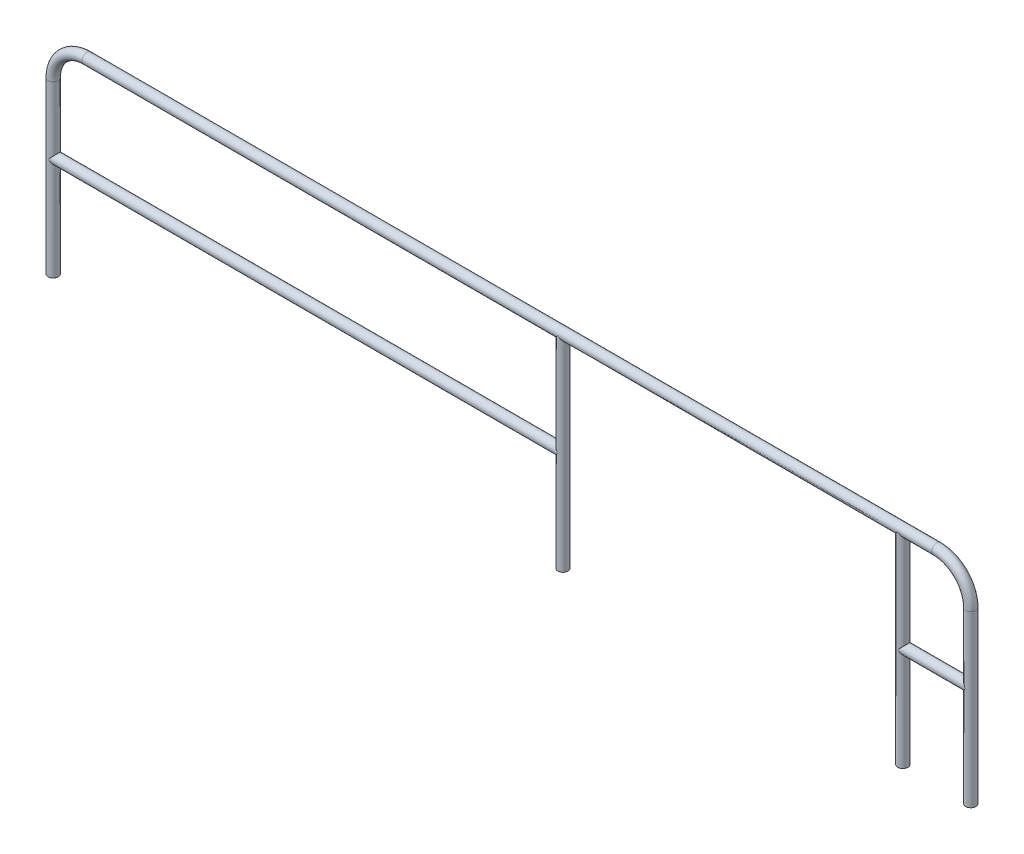
ISO-10303-21;
HEADER;
FILE_DESCRIPTION(('STEP AP214'),'2;1');
FILE_NAME('part.step','',(''),(''),'','','');
FILE_SCHEMA(('AUTOMOTIVE_DESIGN { 1 0 10303 214 1 1 1 1 }'));
ENDSEC;
DATA;
#1=APPLICATION_CONTEXT('core data for automotive mechanical design processes');
#2=APPLICATION_PROTOCOL_DEFINITION('international standard','automotive_design',2000,#1);
#3=PRODUCT_CONTEXT('',#1,'mechanical');
#4=PRODUCT('Part','Part','',(#3));
#5=PRODUCT_RELATED_PRODUCT_CATEGORY('part','',(#4));
#6=PRODUCT_DEFINITION_FORMATION('','',#4);
#7=PRODUCT_DEFINITION_CONTEXT('part definition',#1,'design');
#8=PRODUCT_DEFINITION('design','',#6,#7);
#9=PRODUCT_DEFINITION_SHAPE('','',#8);
#10=(LENGTH_UNIT() NAMED_UNIT(*) SI_UNIT(.MILLI.,.METRE.));
#11=(NAMED_UNIT(*) PLANE_ANGLE_UNIT() SI_UNIT($,.RADIAN.));
#12=(NAMED_UNIT(*) SI_UNIT($,.STERADIAN.) SOLID_ANGLE_UNIT());
#13=UNCERTAINTY_MEASURE_WITH_UNIT(LENGTH_MEASURE(1.E-05),#10,'distance_accuracy_value','');
#14=(GEOMETRIC_REPRESENTATION_CONTEXT(3) GLOBAL_UNCERTAINTY_ASSIGNED_CONTEXT((#13)) GLOBAL_UNIT_ASSIGNED_CONTEXT((#10,
#11,#12)) REPRESENTATION_CONTEXT('',''));
#15=CARTESIAN_POINT('',(0.,0.,0.));
#16=DIRECTION('',(0.,0.,1.));
#17=DIRECTION('',(1.,0.,0.));
#18=AXIS2_PLACEMENT_3D('',#15,#16,#17);
#19=CARTESIAN_POINT('',(50.,25.,0.));
#20=DIRECTION('',(0.,-1.,0.));
#21=DIRECTION('',(1.,0.,0.));
#22=AXIS2_PLACEMENT_3D('',#19,#20,#21);
#23=CYLINDRICAL_SURFACE('',#22,0.749999999999999);
#24=CARTESIAN_POINT('',(50.,0.,0.));
#25=DIRECTION('',(0.,-1.,0.));
#26=DIRECTION('',(0.,0.,1.));
#27=AXIS2_PLACEMENT_3D('',#24,#25,#26);
#28=CIRCLE('',#27,0.749999999999999);
#29=CARTESIAN_POINT('',(50.,0.,0.749999999999999));
#30=VERTEX_POINT('',#29);
#31=EDGE_CURVE('E104',#30,#30,#28,.T.);
#32=ORIENTED_EDGE('',*,*,#31,.F.);
#33=EDGE_LOOP('',(#32));
#34=FACE_BOUND('',#33,.T.);
#35=CARTESIAN_POINT('',(50.,25.,0.));
#36=DIRECTION('',(0.,-1.,0.));
#37=DIRECTION('',(0.,0.,1.));
#38=AXIS2_PLACEMENT_3D('',#35,#36,#37);
#39=CIRCLE('',#38,0.749999999999999);
#40=CARTESIAN_POINT('',(50.75,25.,0.));
#41=VERTEX_POINT('',#40);
#42=EDGE_CURVE('E107',#41,#41,#39,.T.);
#43=ORIENTED_EDGE('',*,*,#42,.T.);
#44=EDGE_LOOP('',(#43));
#45=FACE_BOUND('',#44,.T.);
#46=CARTESIAN_POINT('',(50.,15.,0.));
#47=DIRECTION('',(-0.707106781186547,-0.707106781186548,0.));
#48=DIRECTION('',(0.707106781186548,-0.707106781186547,0.));
#49=AXIS2_PLACEMENT_3D('',#46,#47,#48);
#50=ELLIPSE('',#49,1.06066017177982,0.749999999999999);
#51=CARTESIAN_POINT('',(50.,15.,-0.749999999999999));
#52=VERTEX_POINT('',#51);
#53=CARTESIAN_POINT('',(50.,15.,0.749999999999999));
#54=VERTEX_POINT('',#53);
#55=EDGE_CURVE('E135',#52,#54,#50,.F.);
#56=ORIENTED_EDGE('',*,*,#55,.T.);
#57=CARTESIAN_POINT('',(50.,15.,0.));
#58=DIRECTION('',(0.707106781186548,-0.707106781186547,0.));
#59=DIRECTION('',(-0.707106781186547,-0.707106781186548,0.));
#60=AXIS2_PLACEMENT_3D('',#57,#58,#59);
#61=ELLIPSE('',#60,1.06066017177982,0.749999999999999);
#62=EDGE_CURVE('E48',#54,#52,#61,.T.);
#63=ORIENTED_EDGE('',*,*,#62,.T.);
#64=EDGE_LOOP('',(#56,#63));
#65=FACE_BOUND('',#64,.T.);
#66=ADVANCED_FACE('F35',(#34,#45,#65),#23,.T.);
#67=CARTESIAN_POINT('',(40.,30.,0.));
#68=DIRECTION('',(0.,-1.,0.));
#69=DIRECTION('',(0.,0.,-1.));
#70=AXIS2_PLACEMENT_3D('',#67,#68,#69);
#71=CYLINDRICAL_SURFACE('',#70,0.749999999999999);
#72=CARTESIAN_POINT('',(40.,0.,0.));
#73=DIRECTION('',(0.,1.,0.));
#74=DIRECTION('',(0.,0.,1.));
#75=AXIS2_PLACEMENT_3D('',#72,#73,#74);
#76=CIRCLE('',#75,0.749999999999999);
#77=CARTESIAN_POINT('',(40.,0.,0.75));
#78=VERTEX_POINT('',#77);
#79=EDGE_CURVE('E120',#78,#78,#76,.T.);
#80=ORIENTED_EDGE('',*,*,#79,.T.);
#81=EDGE_LOOP('',(#80));
#82=FACE_BOUND('',#81,.T.);
#83=CARTESIAN_POINT('',(40.,30.,0.));
#84=DIRECTION('',(0.707106781186548,-0.707106781186547,0.));
#85=DIRECTION('',(0.707106781186547,0.707106781186548,0.));
#86=AXIS2_PLACEMENT_3D('',#83,#84,#85);
#87=ELLIPSE('',#86,1.06066017177982,0.749999999999999);
#88=CARTESIAN_POINT('',(40.,30.,-0.749999999999999));
#89=VERTEX_POINT('',#88);
#90=CARTESIAN_POINT('',(40.,30.,0.749999999999999));
#91=VERTEX_POINT('',#90);
#92=EDGE_CURVE('E98',#89,#91,#87,.F.);
#93=ORIENTED_EDGE('',*,*,#92,.F.);
#94=CARTESIAN_POINT('',(40.,30.,0.));
#95=DIRECTION('',(0.707106781186547,0.707106781186548,0.));
#96=DIRECTION('',(0.707106781186548,-0.707106781186547,0.));
#97=AXIS2_PLACEMENT_3D('',#94,#95,#96);
#98=ELLIPSE('',#97,1.06066017177982,0.749999999999999);
#99=EDGE_CURVE('E101',#91,#89,#98,.T.);
#100=ORIENTED_EDGE('',*,*,#99,.F.);
#101=EDGE_LOOP('',(#93,#100));
#102=FACE_BOUND('',#101,.T.);
#103=CARTESIAN_POINT('',(40.,15.,0.));
#104=DIRECTION('',(0.707106781186548,-0.707106781186547,0.));
#105=DIRECTION('',(-0.707106781186547,-0.707106781186548,0.));
#106=AXIS2_PLACEMENT_3D('',#103,#104,#105);
#107=ELLIPSE('',#106,1.06066017177982,0.749999999999999);
#108=CARTESIAN_POINT('',(40.,15.,-0.749999999999998));
#109=VERTEX_POINT('',#108);
#110=CARTESIAN_POINT('',(40.,15.,0.75));
#111=VERTEX_POINT('',#110);
#112=EDGE_CURVE('E11',#109,#111,#107,.T.);
#113=ORIENTED_EDGE('',*,*,#112,.F.);
#114=CARTESIAN_POINT('',(40.,15.,0.));
#115=DIRECTION('',(-0.707106781186547,-0.707106781186548,0.));
#116=DIRECTION('',(0.707106781186548,-0.707106781186547,0.));
#117=AXIS2_PLACEMENT_3D('',#114,#115,#116);
#118=ELLIPSE('',#117,1.06066017177982,0.749999999999999);
#119=EDGE_CURVE('E42',#111,#109,#118,.F.);
#120=ORIENTED_EDGE('',*,*,#119,.F.);
#121=EDGE_LOOP('',(#113,#120));
#122=FACE_BOUND('',#121,.T.);
#123=ADVANCED_FACE('F82',(#82,#102,#122),#71,.T.);
#124=CARTESIAN_POINT('',(-85.,25.,0.));
#125=DIRECTION('',(0.,-1.,0.));
#126=DIRECTION('',(1.,0.,0.));
#127=AXIS2_PLACEMENT_3D('',#124,#125,#126);
#128=CYLINDRICAL_SURFACE('',#127,0.749999999999999);
#129=CARTESIAN_POINT('',(-85.,0.,0.));
#130=DIRECTION('',(0.,1.,0.));
#131=DIRECTION('',(0.,0.,1.));
#132=AXIS2_PLACEMENT_3D('',#129,#130,#131);
#133=CIRCLE('',#132,0.749999999999999);
#134=CARTESIAN_POINT('',(-85.,0.,0.749999999999999));
#135=VERTEX_POINT('',#134);
#136=EDGE_CURVE('E117',#135,#135,#133,.T.);
#137=ORIENTED_EDGE('',*,*,#136,.T.);
#138=EDGE_LOOP('',(#137));
#139=FACE_BOUND('',#138,.T.);
#140=CARTESIAN_POINT('',(-85.,25.,0.));
#141=DIRECTION('',(0.,1.,0.));
#142=DIRECTION('',(0.,0.,1.));
#143=AXIS2_PLACEMENT_3D('',#140,#141,#142);
#144=CIRCLE('',#143,0.749999999999999);
#145=CARTESIAN_POINT('',(-85.75,25.,0.));
#146=VERTEX_POINT('',#145);
#147=EDGE_CURVE('E116',#146,#146,#144,.T.);
#148=ORIENTED_EDGE('',*,*,#147,.F.);
#149=EDGE_LOOP('',(#148));
#150=FACE_BOUND('',#149,.T.);
#151=CARTESIAN_POINT('',(-85.,15.,0.));
#152=DIRECTION('',(-0.707106781186548,-0.707106781186547,0.));
#153=DIRECTION('',(0.707106781186547,-0.707106781186548,0.));
#154=AXIS2_PLACEMENT_3D('',#151,#152,#153);
#155=ELLIPSE('',#154,1.06066017177983,0.750000000000004);
#156=CARTESIAN_POINT('',(-85.,15.,0.749999999999999));
#157=VERTEX_POINT('',#156);
#158=CARTESIAN_POINT('',(-85.,15.,-0.749999999999999));
#159=VERTEX_POINT('',#158);
#160=EDGE_CURVE('E128',#157,#159,#155,.F.);
#161=ORIENTED_EDGE('',*,*,#160,.F.);
#162=CARTESIAN_POINT('',(-85.,15.,0.));
#163=DIRECTION('',(0.707106781186547,-0.707106781186548,0.));
#164=DIRECTION('',(-0.707106781186548,-0.707106781186547,0.));
#165=AXIS2_PLACEMENT_3D('',#162,#163,#164);
#166=ELLIPSE('',#165,1.06066017177983,0.750000000000004);
#167=EDGE_CURVE('E131',#159,#157,#166,.T.);
#168=ORIENTED_EDGE('',*,*,#167,.F.);
#169=EDGE_LOOP('',(#161,#168));
#170=FACE_BOUND('',#169,.T.);
#171=ADVANCED_FACE('F153',(#139,#150,#170),#128,.T.);
#172=CARTESIAN_POINT('',(-9.99999999999999,30.,0.));
#173=DIRECTION('',(0.,-1.,0.));
#174=DIRECTION('',(0.,0.,-1.));
#175=AXIS2_PLACEMENT_3D('',#172,#173,#174);
#176=CYLINDRICAL_SURFACE('',#175,0.75);
#177=CARTESIAN_POINT('',(-9.99999999999999,0.,0.));
#178=DIRECTION('',(0.,1.,0.));
#179=DIRECTION('',(0.,0.,1.));
#180=AXIS2_PLACEMENT_3D('',#177,#178,#179);
#181=CIRCLE('',#180,0.75);
#182=CARTESIAN_POINT('',(-9.99999999999999,0.,0.749999999999991));
#183=VERTEX_POINT('',#182);
#184=EDGE_CURVE('E125',#183,#183,#181,.T.);
#185=ORIENTED_EDGE('',*,*,#184,.T.);
#186=EDGE_LOOP('',(#185));
#187=FACE_BOUND('',#186,.T.);
#188=CARTESIAN_POINT('',(-9.99999999999999,30.,0.));
#189=DIRECTION('',(0.707106781186548,-0.707106781186547,0.));
#190=DIRECTION('',(0.707106781186547,0.707106781186548,0.));
#191=AXIS2_PLACEMENT_3D('',#188,#189,#190);
#192=ELLIPSE('',#191,1.06066017177982,0.75);
#193=CARTESIAN_POINT('',(-9.99999999999999,30.,-0.749999999999999));
#194=VERTEX_POINT('',#193);
#195=CARTESIAN_POINT('',(-9.99999999999999,30.,0.749999999999999));
#196=VERTEX_POINT('',#195);
#197=EDGE_CURVE('E92',#194,#196,#192,.F.);
#198=ORIENTED_EDGE('',*,*,#197,.F.);
#199=CARTESIAN_POINT('',(-9.99999999999999,30.,0.));
#200=DIRECTION('',(0.707106781186547,0.707106781186548,0.));
#201=DIRECTION('',(0.707106781186548,-0.707106781186547,0.));
#202=AXIS2_PLACEMENT_3D('',#199,#200,#201);
#203=ELLIPSE('',#202,1.06066017177982,0.75);
#204=EDGE_CURVE('E95',#196,#194,#203,.T.);
#205=ORIENTED_EDGE('',*,*,#204,.F.);
#206=EDGE_LOOP('',(#198,#205));
#207=FACE_BOUND('',#206,.T.);
#208=CARTESIAN_POINT('',(-9.99999999999999,15.,0.));
#209=DIRECTION('',(-0.707106781186547,-0.707106781186547,0.));
#210=DIRECTION('',(0.707106781186547,-0.707106781186547,0.));
#211=AXIS2_PLACEMENT_3D('',#208,#209,#210);
#212=ELLIPSE('',#211,1.06066017177983,0.750000000000005);
#213=CARTESIAN_POINT('',(-10.,15.,0.749999999999991));
#214=VERTEX_POINT('',#213);
#215=CARTESIAN_POINT('',(-10.,15.,-0.75000000000001));
#216=VERTEX_POINT('',#215);
#217=EDGE_CURVE('E85',#214,#216,#212,.T.);
#218=ORIENTED_EDGE('',*,*,#217,.F.);
#219=CARTESIAN_POINT('',(-9.99999999999999,15.,0.));
#220=DIRECTION('',(0.707106781186547,-0.707106781186547,0.));
#221=DIRECTION('',(-0.707106781186547,-0.707106781186547,0.));
#222=AXIS2_PLACEMENT_3D('',#219,#220,#221);
#223=ELLIPSE('',#222,1.06066017177983,0.750000000000005);
#224=EDGE_CURVE('E87',#216,#214,#223,.F.);
#225=ORIENTED_EDGE('',*,*,#224,.F.);
#226=EDGE_LOOP('',(#218,#225));
#227=FACE_BOUND('',#226,.T.);
#228=ADVANCED_FACE('F172',(#187,#207,#227),#176,.T.);
#229=CARTESIAN_POINT('',(-80.,30.,0.));
#230=DIRECTION('',(1.,0.,0.));
#231=DIRECTION('',(0.,1.,0.));
#232=AXIS2_PLACEMENT_3D('',#229,#230,#231);
#233=CYLINDRICAL_SURFACE('',#232,0.749999999999999);
#234=ORIENTED_EDGE('',*,*,#99,.T.);
#235=ORIENTED_EDGE('',*,*,#92,.T.);
#236=EDGE_LOOP('',(#234,#235));
#237=FACE_BOUND('',#236,.T.);
#238=CARTESIAN_POINT('',(-80.,30.,0.));
#239=DIRECTION('',(1.,0.,0.));
#240=DIRECTION('',(0.,0.,1.));
#241=AXIS2_PLACEMENT_3D('',#238,#239,#240);
#242=CIRCLE('',#241,0.749999999999999);
#243=CARTESIAN_POINT('',(-80.,30.75,0.));
#244=VERTEX_POINT('',#243);
#245=EDGE_CURVE('E113',#244,#244,#242,.T.);
#246=ORIENTED_EDGE('',*,*,#245,.T.);
#247=EDGE_LOOP('',(#246));
#248=FACE_BOUND('',#247,.T.);
#249=CARTESIAN_POINT('',(45.,30.,0.));
#250=DIRECTION('',(1.,0.,0.));
#251=DIRECTION('',(0.,0.,1.));
#252=AXIS2_PLACEMENT_3D('',#249,#250,#251);
#253=CIRCLE('',#252,0.749999999999999);
#254=CARTESIAN_POINT('',(45.,30.75,0.));
#255=VERTEX_POINT('',#254);
#256=EDGE_CURVE('E110',#255,#255,#253,.T.);
#257=ORIENTED_EDGE('',*,*,#256,.F.);
#258=EDGE_LOOP('',(#257));
#259=FACE_BOUND('',#258,.T.);
#260=ORIENTED_EDGE('',*,*,#204,.T.);
#261=ORIENTED_EDGE('',*,*,#197,.T.);
#262=EDGE_LOOP('',(#260,#261));
#263=FACE_BOUND('',#262,.T.);
#264=ADVANCED_FACE('F163',(#237,#248,#259,#263),#233,.T.);
#265=CARTESIAN_POINT('',(45.,25.,0.));
#266=DIRECTION('',(0.,0.,-1.));
#267=DIRECTION('',(-1.,0.,0.));
#268=AXIS2_PLACEMENT_3D('',#265,#266,#267);
#269=TOROIDAL_SURFACE('',#268,4.99999999999998,0.749999999999999);
#270=CARTESIAN_POINT('',(45.,25.,0.));
#271=DIRECTION('',(0.,0.,-1.));
#272=DIRECTION('',(-1.,0.,0.));
#273=AXIS2_PLACEMENT_3D('',#270,#271,#272);
#274=CIRCLE('',#273,5.74999999999998);
#275=EDGE_CURVE('',#255,#41,#274,.T.);
#276=ORIENTED_EDGE('',*,*,#256,.T.);
#277=ORIENTED_EDGE('',*,*,#42,.F.);
#278=ORIENTED_EDGE('',*,*,#275,.T.);
#279=ORIENTED_EDGE('',*,*,#275,.F.);
#280=EDGE_LOOP('',(#276,#278,#277,#279));
#281=FACE_BOUND('',#280,.T.);
#282=ADVANCED_FACE('F160',(#281),#269,.T.);
#283=CARTESIAN_POINT('',(-80.,25.,0.));
#284=DIRECTION('',(0.,0.,-1.));
#285=DIRECTION('',(-1.,0.,0.));
#286=AXIS2_PLACEMENT_3D('',#283,#284,#285);
#287=TOROIDAL_SURFACE('',#286,4.99999999999999,0.749999999999999);
#288=CARTESIAN_POINT('',(-80.,25.,0.));
#289=DIRECTION('',(0.,0.,-1.));
#290=DIRECTION('',(-1.,0.,0.));
#291=AXIS2_PLACEMENT_3D('',#288,#289,#290);
#292=CIRCLE('',#291,5.74999999999999);
#293=EDGE_CURVE('',#146,#244,#292,.T.);
#294=ORIENTED_EDGE('',*,*,#147,.T.);
#295=ORIENTED_EDGE('',*,*,#245,.F.);
#296=ORIENTED_EDGE('',*,*,#293,.T.);
#297=ORIENTED_EDGE('',*,*,#293,.F.);
#298=EDGE_LOOP('',(#294,#296,#295,#297));
#299=FACE_BOUND('',#298,.T.);
#300=ADVANCED_FACE('F162',(#299),#287,.T.);
#301=CARTESIAN_POINT('',(50.,0.,0.));
#302=DIRECTION('',(0.,-1.,0.));
#303=DIRECTION('',(0.,0.,1.));
#304=AXIS2_PLACEMENT_3D('',#301,#302,#303);
#305=PLANE('',#304);
#306=ORIENTED_EDGE('',*,*,#31,.T.);
#307=EDGE_LOOP('',(#306));
#308=FACE_BOUND('',#307,.T.);
#309=ADVANCED_FACE('F169',(#308),#305,.T.);
#310=CARTESIAN_POINT('',(-85.,0.,0.));
#311=DIRECTION('',(0.,1.,0.));
#312=DIRECTION('',(0.,0.,1.));
#313=AXIS2_PLACEMENT_3D('',#310,#311,#312);
#314=PLANE('',#313);
#315=ORIENTED_EDGE('',*,*,#136,.F.);
#316=EDGE_LOOP('',(#315));
#317=FACE_BOUND('',#316,.T.);
#318=ADVANCED_FACE('F179',(#317),#314,.F.);
#319=CARTESIAN_POINT('',(35.7250739648208,0.,0.));
#320=DIRECTION('',(0.,1.,0.));
#321=DIRECTION('',(0.,0.,1.));
#322=AXIS2_PLACEMENT_3D('',#319,#320,#321);
#323=PLANE('',#322);
#324=ORIENTED_EDGE('',*,*,#79,.F.);
#325=EDGE_LOOP('',(#324));
#326=FACE_BOUND('',#325,.T.);
#327=ADVANCED_FACE('F182',(#326),#323,.F.);
#328=CARTESIAN_POINT('',(-106.272400718238,0.,0.));
#329=DIRECTION('',(0.,1.,0.));
#330=DIRECTION('',(0.,0.,1.));
#331=AXIS2_PLACEMENT_3D('',#328,#329,#330);
#332=PLANE('',#331);
#333=ORIENTED_EDGE('',*,*,#184,.F.);
#334=EDGE_LOOP('',(#333));
#335=FACE_BOUND('',#334,.T.);
#336=ADVANCED_FACE('F144',(#335),#332,.F.);
#337=CARTESIAN_POINT('',(-10.,15.,0.));
#338=DIRECTION('',(-1.,0.,0.));
#339=DIRECTION('',(0.,0.,1.));
#340=AXIS2_PLACEMENT_3D('',#337,#338,#339);
#341=CYLINDRICAL_SURFACE('',#340,0.750000000000009);
#342=ORIENTED_EDGE('',*,*,#224,.T.);
#343=ORIENTED_EDGE('',*,*,#217,.T.);
#344=EDGE_LOOP('',(#342,#343));
#345=FACE_BOUND('',#344,.T.);
#346=ORIENTED_EDGE('',*,*,#167,.T.);
#347=ORIENTED_EDGE('',*,*,#160,.T.);
#348=EDGE_LOOP('',(#346,#347));
#349=FACE_BOUND('',#348,.T.);
#350=ADVANCED_FACE('F138',(#345,#349),#341,.T.);
#351=CARTESIAN_POINT('',(40.,15.,0.));
#352=DIRECTION('',(1.,0.,0.));
#353=DIRECTION('',(0.,1.,0.));
#354=AXIS2_PLACEMENT_3D('',#351,#352,#353);
#355=CYLINDRICAL_SURFACE('',#354,0.75);
#356=ORIENTED_EDGE('',*,*,#62,.F.);
#357=ORIENTED_EDGE('',*,*,#55,.F.);
#358=EDGE_LOOP('',(#356,#357));
#359=FACE_BOUND('',#358,.T.);
#360=ORIENTED_EDGE('',*,*,#119,.T.);
#361=ORIENTED_EDGE('',*,*,#112,.T.);
#362=EDGE_LOOP('',(#360,#361));
#363=FACE_BOUND('',#362,.T.);
#364=ADVANCED_FACE('F84',(#359,#363),#355,.T.);
#365=CLOSED_SHELL('',(#66,#123,#171,#228,#264,#282,#300,#309,#318,#327,#336,#350,#364));
#366=MANIFOLD_SOLID_BREP('B2',#365);
#367=ADVANCED_BREP_SHAPE_REPRESENTATION('',(#18,#366),#14);
#368=SHAPE_DEFINITION_REPRESENTATION(#9,#367);
ENDSEC;
END-ISO-10303-21;
